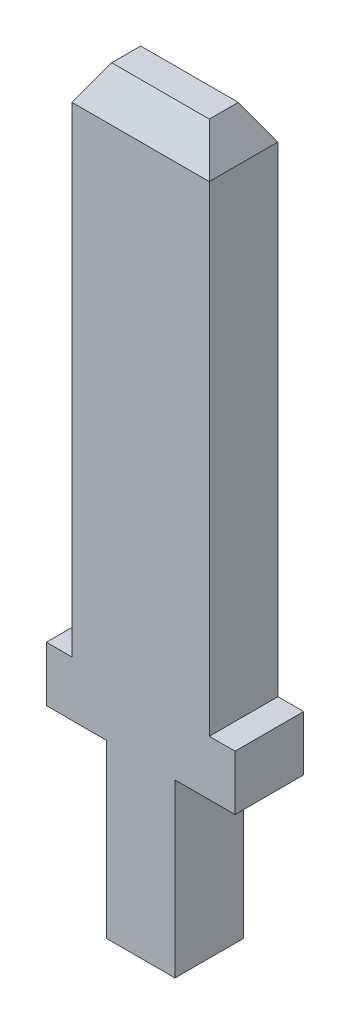
ISO-10303-21;
HEADER;
FILE_DESCRIPTION(('STEP AP214'),'2;1');
FILE_NAME('part.step','',(''),(''),'','','');
FILE_SCHEMA(('AUTOMOTIVE_DESIGN { 1 0 10303 214 1 1 1 1 }'));
ENDSEC;
DATA;
#1=APPLICATION_CONTEXT('core data for automotive mechanical design processes');
#2=APPLICATION_PROTOCOL_DEFINITION('international standard','automotive_design',2000,#1);
#3=PRODUCT_CONTEXT('',#1,'mechanical');
#4=PRODUCT('Part','Part','',(#3));
#5=PRODUCT_RELATED_PRODUCT_CATEGORY('part','',(#4));
#6=PRODUCT_DEFINITION_FORMATION('','',#4);
#7=PRODUCT_DEFINITION_CONTEXT('part definition',#1,'design');
#8=PRODUCT_DEFINITION('design','',#6,#7);
#9=PRODUCT_DEFINITION_SHAPE('','',#8);
#10=(LENGTH_UNIT() NAMED_UNIT(*) SI_UNIT(.MILLI.,.METRE.));
#11=(NAMED_UNIT(*) PLANE_ANGLE_UNIT() SI_UNIT($,.RADIAN.));
#12=(NAMED_UNIT(*) SI_UNIT($,.STERADIAN.) SOLID_ANGLE_UNIT());
#13=UNCERTAINTY_MEASURE_WITH_UNIT(LENGTH_MEASURE(1.E-05),#10,'distance_accuracy_value','');
#14=(GEOMETRIC_REPRESENTATION_CONTEXT(3) GLOBAL_UNCERTAINTY_ASSIGNED_CONTEXT((#13)) GLOBAL_UNIT_ASSIGNED_CONTEXT((#10,
#11,#12)) REPRESENTATION_CONTEXT('',''));
#15=CARTESIAN_POINT('',(0.,0.,0.));
#16=DIRECTION('',(0.,0.,1.));
#17=DIRECTION('',(1.,0.,0.));
#18=AXIS2_PLACEMENT_3D('',#15,#16,#17);
#19=CARTESIAN_POINT('',(-0.999999999999998,0.,1.));
#20=DIRECTION('',(1.,0.,0.));
#21=DIRECTION('',(0.,1.,0.));
#22=AXIS2_PLACEMENT_3D('',#19,#20,#21);
#23=PLANE('',#22);
#24=DIRECTION('',(0.,-1.,0.));
#25=VECTOR('',#24,1.);
#26=CARTESIAN_POINT('',(-0.999999999999998,0.,-1.));
#27=LINE('',#26,#25);
#28=CARTESIAN_POINT('',(-0.999999999999998,5.,-1.));
#29=VERTEX_POINT('',#28);
#30=CARTESIAN_POINT('',(-0.999999999999998,0.,-1.));
#31=VERTEX_POINT('',#30);
#32=EDGE_CURVE('E158',#29,#31,#27,.T.);
#33=ORIENTED_EDGE('',*,*,#32,.T.);
#34=DIRECTION('',(0.,0.,-1.));
#35=VECTOR('',#34,1.);
#36=CARTESIAN_POINT('',(-0.999999999999998,0.,1.));
#37=LINE('',#36,#35);
#38=CARTESIAN_POINT('',(-0.999999999999998,0.,1.));
#39=VERTEX_POINT('',#38);
#40=EDGE_CURVE('E140',#39,#31,#37,.T.);
#41=ORIENTED_EDGE('',*,*,#40,.F.);
#42=DIRECTION('',(0.,-1.,0.));
#43=VECTOR('',#42,1.);
#44=CARTESIAN_POINT('',(-0.999999999999998,0.,1.));
#45=LINE('',#44,#43);
#46=CARTESIAN_POINT('',(-0.999999999999998,5.,1.));
#47=VERTEX_POINT('',#46);
#48=EDGE_CURVE('E146',#47,#39,#45,.T.);
#49=ORIENTED_EDGE('',*,*,#48,.F.);
#50=DIRECTION('',(0.,0.,-1.));
#51=VECTOR('',#50,1.);
#52=CARTESIAN_POINT('',(-0.999999999999998,5.,1.));
#53=LINE('',#52,#51);
#54=EDGE_CURVE('E215',#47,#29,#53,.T.);
#55=ORIENTED_EDGE('',*,*,#54,.T.);
#56=EDGE_LOOP('',(#33,#41,#49,#55));
#57=FACE_BOUND('',#56,.T.);
#58=ADVANCED_FACE('F34',(#57),#23,.F.);
#59=CARTESIAN_POINT('',(0.999999999999998,0.,1.));
#60=DIRECTION('',(0.,1.,0.));
#61=DIRECTION('',(-1.,0.,0.));
#62=AXIS2_PLACEMENT_3D('',#59,#60,#61);
#63=PLANE('',#62);
#64=DIRECTION('',(1.,0.,0.));
#65=VECTOR('',#64,1.);
#66=CARTESIAN_POINT('',(0.999999999999998,0.,-1.));
#67=LINE('',#66,#65);
#68=CARTESIAN_POINT('',(0.999999999999998,0.,-1.));
#69=VERTEX_POINT('',#68);
#70=EDGE_CURVE('E191',#31,#69,#67,.T.);
#71=ORIENTED_EDGE('',*,*,#70,.T.);
#72=DIRECTION('',(0.,0.,-1.));
#73=VECTOR('',#72,1.);
#74=CARTESIAN_POINT('',(0.999999999999998,0.,1.));
#75=LINE('',#74,#73);
#76=CARTESIAN_POINT('',(0.999999999999998,0.,1.));
#77=VERTEX_POINT('',#76);
#78=EDGE_CURVE('E143',#77,#69,#75,.T.);
#79=ORIENTED_EDGE('',*,*,#78,.F.);
#80=DIRECTION('',(1.,0.,0.));
#81=VECTOR('',#80,1.);
#82=CARTESIAN_POINT('',(0.999999999999998,0.,1.));
#83=LINE('',#82,#81);
#84=EDGE_CURVE('E136',#39,#77,#83,.T.);
#85=ORIENTED_EDGE('',*,*,#84,.F.);
#86=ORIENTED_EDGE('',*,*,#40,.T.);
#87=EDGE_LOOP('',(#71,#79,#85,#86));
#88=FACE_BOUND('',#87,.T.);
#89=ADVANCED_FACE('F138',(#88),#63,.F.);
#90=CARTESIAN_POINT('',(0.999999999999998,0.,1.));
#91=DIRECTION('',(-1.,0.,0.));
#92=DIRECTION('',(0.,-1.,0.));
#93=AXIS2_PLACEMENT_3D('',#90,#91,#92);
#94=PLANE('',#93);
#95=DIRECTION('',(0.,1.,0.));
#96=VECTOR('',#95,1.);
#97=CARTESIAN_POINT('',(0.999999999999998,0.,-1.));
#98=LINE('',#97,#96);
#99=CARTESIAN_POINT('',(1.,5.,-1.));
#100=VERTEX_POINT('',#99);
#101=EDGE_CURVE('E193',#69,#100,#98,.T.);
#102=ORIENTED_EDGE('',*,*,#101,.T.);
#103=DIRECTION('',(0.,0.,-1.));
#104=VECTOR('',#103,1.);
#105=CARTESIAN_POINT('',(1.,5.,1.));
#106=LINE('',#105,#104);
#107=CARTESIAN_POINT('',(1.,5.,1.));
#108=VERTEX_POINT('',#107);
#109=EDGE_CURVE('E163',#108,#100,#106,.T.);
#110=ORIENTED_EDGE('',*,*,#109,.F.);
#111=DIRECTION('',(0.,1.,0.));
#112=VECTOR('',#111,1.);
#113=CARTESIAN_POINT('',(0.999999999999998,0.,1.));
#114=LINE('',#113,#112);
#115=EDGE_CURVE('E145',#77,#108,#114,.T.);
#116=ORIENTED_EDGE('',*,*,#115,.F.);
#117=ORIENTED_EDGE('',*,*,#78,.T.);
#118=EDGE_LOOP('',(#102,#110,#116,#117));
#119=FACE_BOUND('',#118,.T.);
#120=ADVANCED_FACE('F280',(#119),#94,.F.);
#121=CARTESIAN_POINT('',(1.,5.,1.));
#122=DIRECTION('',(0.,1.,0.));
#123=DIRECTION('',(-1.,0.,0.));
#124=AXIS2_PLACEMENT_3D('',#121,#122,#123);
#125=PLANE('',#124);
#126=DIRECTION('',(1.,0.,0.));
#127=VECTOR('',#126,1.);
#128=CARTESIAN_POINT('',(1.,5.,-1.));
#129=LINE('',#128,#127);
#130=CARTESIAN_POINT('',(2.75,5.,-1.));
#131=VERTEX_POINT('',#130);
#132=EDGE_CURVE('E199',#100,#131,#129,.T.);
#133=ORIENTED_EDGE('',*,*,#132,.T.);
#134=DIRECTION('',(0.,0.,-1.));
#135=VECTOR('',#134,1.);
#136=CARTESIAN_POINT('',(2.75,5.,1.));
#137=LINE('',#136,#135);
#138=CARTESIAN_POINT('',(2.75,5.,1.));
#139=VERTEX_POINT('',#138);
#140=EDGE_CURVE('E232',#139,#131,#137,.T.);
#141=ORIENTED_EDGE('',*,*,#140,.F.);
#142=DIRECTION('',(1.,0.,0.));
#143=VECTOR('',#142,1.);
#144=CARTESIAN_POINT('',(1.,5.,1.));
#145=LINE('',#144,#143);
#146=EDGE_CURVE('E241',#108,#139,#145,.T.);
#147=ORIENTED_EDGE('',*,*,#146,.F.);
#148=ORIENTED_EDGE('',*,*,#109,.T.);
#149=EDGE_LOOP('',(#133,#141,#147,#148));
#150=FACE_BOUND('',#149,.T.);
#151=ADVANCED_FACE('F239',(#150),#125,.F.);
#152=CARTESIAN_POINT('',(2.75,5.,1.));
#153=DIRECTION('',(-1.,0.,0.));
#154=DIRECTION('',(0.,-1.,0.));
#155=AXIS2_PLACEMENT_3D('',#152,#153,#154);
#156=PLANE('',#155);
#157=DIRECTION('',(0.,1.,0.));
#158=VECTOR('',#157,1.);
#159=CARTESIAN_POINT('',(2.75,5.,-1.));
#160=LINE('',#159,#158);
#161=CARTESIAN_POINT('',(2.75,6.6,-1.));
#162=VERTEX_POINT('',#161);
#163=EDGE_CURVE('E201',#131,#162,#160,.T.);
#164=ORIENTED_EDGE('',*,*,#163,.T.);
#165=DIRECTION('',(0.,0.,-1.));
#166=VECTOR('',#165,1.);
#167=CARTESIAN_POINT('',(2.75,6.6,1.));
#168=LINE('',#167,#166);
#169=CARTESIAN_POINT('',(2.75,6.6,1.));
#170=VERTEX_POINT('',#169);
#171=EDGE_CURVE('E229',#170,#162,#168,.T.);
#172=ORIENTED_EDGE('',*,*,#171,.F.);
#173=DIRECTION('',(0.,1.,0.));
#174=VECTOR('',#173,1.);
#175=CARTESIAN_POINT('',(2.75,5.,1.));
#176=LINE('',#175,#174);
#177=EDGE_CURVE('E260',#139,#170,#176,.T.);
#178=ORIENTED_EDGE('',*,*,#177,.F.);
#179=ORIENTED_EDGE('',*,*,#140,.T.);
#180=EDGE_LOOP('',(#164,#172,#178,#179));
#181=FACE_BOUND('',#180,.T.);
#182=ADVANCED_FACE('F251',(#181),#156,.F.);
#183=CARTESIAN_POINT('',(2.75,6.6,1.));
#184=DIRECTION('',(0.,-1.,0.));
#185=DIRECTION('',(0.,0.,-1.));
#186=AXIS2_PLACEMENT_3D('',#183,#184,#185);
#187=PLANE('',#186);
#188=DIRECTION('',(-1.,0.,0.));
#189=VECTOR('',#188,1.);
#190=CARTESIAN_POINT('',(2.75,6.6,-1.));
#191=LINE('',#190,#189);
#192=CARTESIAN_POINT('',(2.,6.6,-1.));
#193=VERTEX_POINT('',#192);
#194=EDGE_CURVE('E203',#162,#193,#191,.T.);
#195=ORIENTED_EDGE('',*,*,#194,.T.);
#196=DIRECTION('',(0.,0.,-1.));
#197=VECTOR('',#196,1.);
#198=CARTESIAN_POINT('',(2.,6.6,1.));
#199=LINE('',#198,#197);
#200=CARTESIAN_POINT('',(2.,6.6,1.));
#201=VERTEX_POINT('',#200);
#202=EDGE_CURVE('E226',#201,#193,#199,.T.);
#203=ORIENTED_EDGE('',*,*,#202,.F.);
#204=DIRECTION('',(-1.,0.,0.));
#205=VECTOR('',#204,1.);
#206=CARTESIAN_POINT('',(2.75,6.6,1.));
#207=LINE('',#206,#205);
#208=EDGE_CURVE('E257',#170,#201,#207,.T.);
#209=ORIENTED_EDGE('',*,*,#208,.F.);
#210=ORIENTED_EDGE('',*,*,#171,.T.);
#211=EDGE_LOOP('',(#195,#203,#209,#210));
#212=FACE_BOUND('',#211,.T.);
#213=ADVANCED_FACE('F255',(#212),#187,.F.);
#214=CARTESIAN_POINT('',(2.,6.6,1.));
#215=DIRECTION('',(-1.,0.,0.));
#216=DIRECTION('',(0.,-1.,0.));
#217=AXIS2_PLACEMENT_3D('',#214,#215,#216);
#218=PLANE('',#217);
#219=DIRECTION('',(0.,1.,0.));
#220=VECTOR('',#219,1.);
#221=CARTESIAN_POINT('',(2.,6.6,-1.));
#222=LINE('',#221,#220);
#223=CARTESIAN_POINT('',(2.,20.6,-1.));
#224=VERTEX_POINT('',#223);
#225=EDGE_CURVE('E205',#193,#224,#222,.T.);
#226=ORIENTED_EDGE('',*,*,#225,.T.);
#227=DIRECTION('',(0.,0.,1.));
#228=VECTOR('',#227,1.);
#229=CARTESIAN_POINT('',(2.,20.6,1.));
#230=LINE('',#229,#228);
#231=CARTESIAN_POINT('',(2.,20.6,1.));
#232=VERTEX_POINT('',#231);
#233=EDGE_CURVE('E173',#224,#232,#230,.T.);
#234=ORIENTED_EDGE('',*,*,#233,.T.);
#235=DIRECTION('',(0.,1.,0.));
#236=VECTOR('',#235,1.);
#237=CARTESIAN_POINT('',(2.,6.6,1.));
#238=LINE('',#237,#236);
#239=EDGE_CURVE('E259',#201,#232,#238,.T.);
#240=ORIENTED_EDGE('',*,*,#239,.F.);
#241=ORIENTED_EDGE('',*,*,#202,.T.);
#242=EDGE_LOOP('',(#226,#234,#240,#241));
#243=FACE_BOUND('',#242,.T.);
#244=ADVANCED_FACE('F316',(#243),#218,.F.);
#245=CARTESIAN_POINT('',(-2.,21.6,1.));
#246=DIRECTION('',(0.,-1.,0.));
#247=DIRECTION('',(0.,0.,-1.));
#248=AXIS2_PLACEMENT_3D('',#245,#246,#247);
#249=PLANE('',#248);
#250=DIRECTION('',(1.,0.,0.));
#251=VECTOR('',#250,1.);
#252=CARTESIAN_POINT('',(2.,21.6,0.422649730810372));
#253=LINE('',#252,#251);
#254=CARTESIAN_POINT('',(-1.42264973081037,21.6,0.422649730810372));
#255=VERTEX_POINT('',#254);
#256=CARTESIAN_POINT('',(1.42264973081037,21.6,0.422649730810372));
#257=VERTEX_POINT('',#256);
#258=EDGE_CURVE('E168',#255,#257,#253,.T.);
#259=ORIENTED_EDGE('',*,*,#258,.T.);
#260=DIRECTION('',(0.,0.,-1.));
#261=VECTOR('',#260,1.);
#262=CARTESIAN_POINT('',(1.42264973081037,21.6,1.));
#263=LINE('',#262,#261);
#264=CARTESIAN_POINT('',(1.42264973081037,21.6,-0.422649730810372));
#265=VERTEX_POINT('',#264);
#266=EDGE_CURVE('E170',#257,#265,#263,.T.);
#267=ORIENTED_EDGE('',*,*,#266,.T.);
#268=DIRECTION('',(-1.,0.,0.));
#269=VECTOR('',#268,1.);
#270=CARTESIAN_POINT('',(-2.,21.6,-0.422649730810372));
#271=LINE('',#270,#269);
#272=CARTESIAN_POINT('',(-1.42264973081037,21.6,-0.422649730810372));
#273=VERTEX_POINT('',#272);
#274=EDGE_CURVE('E159',#265,#273,#271,.T.);
#275=ORIENTED_EDGE('',*,*,#274,.T.);
#276=DIRECTION('',(0.,0.,1.));
#277=VECTOR('',#276,1.);
#278=CARTESIAN_POINT('',(-1.42264973081037,21.6,1.));
#279=LINE('',#278,#277);
#280=EDGE_CURVE('E161',#273,#255,#279,.T.);
#281=ORIENTED_EDGE('',*,*,#280,.T.);
#282=EDGE_LOOP('',(#259,#267,#275,#281));
#283=FACE_BOUND('',#282,.T.);
#284=ADVANCED_FACE('F320',(#283),#249,.F.);
#285=CARTESIAN_POINT('',(-2.,6.6,1.));
#286=DIRECTION('',(1.,0.,0.));
#287=DIRECTION('',(0.,0.,-1.));
#288=AXIS2_PLACEMENT_3D('',#285,#286,#287);
#289=PLANE('',#288);
#290=DIRECTION('',(0.,-1.,0.));
#291=VECTOR('',#290,1.);
#292=CARTESIAN_POINT('',(-2.,6.6,1.));
#293=LINE('',#292,#291);
#294=CARTESIAN_POINT('',(-2.,20.6,1.));
#295=VERTEX_POINT('',#294);
#296=CARTESIAN_POINT('',(-2.,6.6,1.));
#297=VERTEX_POINT('',#296);
#298=EDGE_CURVE('E262',#295,#297,#293,.T.);
#299=ORIENTED_EDGE('',*,*,#298,.F.);
#300=DIRECTION('',(0.,0.,-1.));
#301=VECTOR('',#300,1.);
#302=CARTESIAN_POINT('',(-2.,20.6,1.));
#303=LINE('',#302,#301);
#304=CARTESIAN_POINT('',(-2.,20.6,-1.));
#305=VERTEX_POINT('',#304);
#306=EDGE_CURVE('E43',#295,#305,#303,.T.);
#307=ORIENTED_EDGE('',*,*,#306,.T.);
#308=DIRECTION('',(0.,-1.,0.));
#309=VECTOR('',#308,1.);
#310=CARTESIAN_POINT('',(-2.,6.6,-1.));
#311=LINE('',#310,#309);
#312=CARTESIAN_POINT('',(-2.,6.6,-1.));
#313=VERTEX_POINT('',#312);
#314=EDGE_CURVE('E208',#305,#313,#311,.T.);
#315=ORIENTED_EDGE('',*,*,#314,.T.);
#316=DIRECTION('',(0.,0.,-1.));
#317=VECTOR('',#316,1.);
#318=CARTESIAN_POINT('',(-2.,6.6,1.));
#319=LINE('',#318,#317);
#320=EDGE_CURVE('E223',#297,#313,#319,.T.);
#321=ORIENTED_EDGE('',*,*,#320,.F.);
#322=EDGE_LOOP('',(#299,#307,#315,#321));
#323=FACE_BOUND('',#322,.T.);
#324=ADVANCED_FACE('F322',(#323),#289,.F.);
#325=CARTESIAN_POINT('',(-2.75,6.6,1.));
#326=DIRECTION('',(0.,-1.,0.));
#327=DIRECTION('',(0.,0.,-1.));
#328=AXIS2_PLACEMENT_3D('',#325,#326,#327);
#329=PLANE('',#328);
#330=DIRECTION('',(-1.,0.,0.));
#331=VECTOR('',#330,1.);
#332=CARTESIAN_POINT('',(-2.75,6.6,-1.));
#333=LINE('',#332,#331);
#334=CARTESIAN_POINT('',(-2.75,6.6,-1.));
#335=VERTEX_POINT('',#334);
#336=EDGE_CURVE('E210',#313,#335,#333,.T.);
#337=ORIENTED_EDGE('',*,*,#336,.T.);
#338=DIRECTION('',(0.,0.,-1.));
#339=VECTOR('',#338,1.);
#340=CARTESIAN_POINT('',(-2.75,6.6,1.));
#341=LINE('',#340,#339);
#342=CARTESIAN_POINT('',(-2.75,6.6,1.));
#343=VERTEX_POINT('',#342);
#344=EDGE_CURVE('E220',#343,#335,#341,.T.);
#345=ORIENTED_EDGE('',*,*,#344,.F.);
#346=DIRECTION('',(-1.,0.,0.));
#347=VECTOR('',#346,1.);
#348=CARTESIAN_POINT('',(-2.75,6.6,1.));
#349=LINE('',#348,#347);
#350=EDGE_CURVE('E268',#297,#343,#349,.T.);
#351=ORIENTED_EDGE('',*,*,#350,.F.);
#352=ORIENTED_EDGE('',*,*,#320,.T.);
#353=EDGE_LOOP('',(#337,#345,#351,#352));
#354=FACE_BOUND('',#353,.T.);
#355=ADVANCED_FACE('F328',(#354),#329,.F.);
#356=CARTESIAN_POINT('',(-2.75,5.,1.));
#357=DIRECTION('',(1.,0.,0.));
#358=DIRECTION('',(0.,0.,-1.));
#359=AXIS2_PLACEMENT_3D('',#356,#357,#358);
#360=PLANE('',#359);
#361=DIRECTION('',(0.,-1.,0.));
#362=VECTOR('',#361,1.);
#363=CARTESIAN_POINT('',(-2.75,5.,-1.));
#364=LINE('',#363,#362);
#365=CARTESIAN_POINT('',(-2.75,5.,-1.));
#366=VERTEX_POINT('',#365);
#367=EDGE_CURVE('E212',#335,#366,#364,.T.);
#368=ORIENTED_EDGE('',*,*,#367,.T.);
#369=DIRECTION('',(0.,0.,-1.));
#370=VECTOR('',#369,1.);
#371=CARTESIAN_POINT('',(-2.75,5.,1.));
#372=LINE('',#371,#370);
#373=CARTESIAN_POINT('',(-2.75,5.,1.));
#374=VERTEX_POINT('',#373);
#375=EDGE_CURVE('E217',#374,#366,#372,.T.);
#376=ORIENTED_EDGE('',*,*,#375,.F.);
#377=DIRECTION('',(0.,-1.,0.));
#378=VECTOR('',#377,1.);
#379=CARTESIAN_POINT('',(-2.75,5.,1.));
#380=LINE('',#379,#378);
#381=EDGE_CURVE('E269',#343,#374,#380,.T.);
#382=ORIENTED_EDGE('',*,*,#381,.F.);
#383=ORIENTED_EDGE('',*,*,#344,.T.);
#384=EDGE_LOOP('',(#368,#376,#382,#383));
#385=FACE_BOUND('',#384,.T.);
#386=ADVANCED_FACE('F275',(#385),#360,.F.);
#387=CARTESIAN_POINT('',(-0.999999999999998,5.,1.));
#388=DIRECTION('',(0.,1.,0.));
#389=DIRECTION('',(0.,0.,1.));
#390=AXIS2_PLACEMENT_3D('',#387,#388,#389);
#391=PLANE('',#390);
#392=DIRECTION('',(1.,0.,0.));
#393=VECTOR('',#392,1.);
#394=CARTESIAN_POINT('',(-0.999999999999998,5.,-1.));
#395=LINE('',#394,#393);
#396=EDGE_CURVE('E155',#366,#29,#395,.T.);
#397=ORIENTED_EDGE('',*,*,#396,.T.);
#398=ORIENTED_EDGE('',*,*,#54,.F.);
#399=DIRECTION('',(1.,0.,0.));
#400=VECTOR('',#399,1.);
#401=CARTESIAN_POINT('',(-0.999999999999998,5.,1.));
#402=LINE('',#401,#400);
#403=EDGE_CURVE('E151',#374,#47,#402,.T.);
#404=ORIENTED_EDGE('',*,*,#403,.F.);
#405=ORIENTED_EDGE('',*,*,#375,.T.);
#406=EDGE_LOOP('',(#397,#398,#404,#405));
#407=FACE_BOUND('',#406,.T.);
#408=ADVANCED_FACE('F279',(#407),#391,.F.);
#409=CARTESIAN_POINT('',(0.,0.,1.));
#410=DIRECTION('',(0.,0.,1.));
#411=DIRECTION('',(1.,0.,0.));
#412=AXIS2_PLACEMENT_3D('',#409,#410,#411);
#413=PLANE('',#412);
#414=ORIENTED_EDGE('',*,*,#239,.T.);
#415=DIRECTION('',(-1.,0.,0.));
#416=VECTOR('',#415,1.);
#417=CARTESIAN_POINT('',(-2.,20.6,1.));
#418=LINE('',#417,#416);
#419=EDGE_CURVE('E58',#232,#295,#418,.T.);
#420=ORIENTED_EDGE('',*,*,#419,.T.);
#421=ORIENTED_EDGE('',*,*,#298,.T.);
#422=ORIENTED_EDGE('',*,*,#350,.T.);
#423=ORIENTED_EDGE('',*,*,#381,.T.);
#424=ORIENTED_EDGE('',*,*,#403,.T.);
#425=ORIENTED_EDGE('',*,*,#48,.T.);
#426=ORIENTED_EDGE('',*,*,#84,.T.);
#427=ORIENTED_EDGE('',*,*,#115,.T.);
#428=ORIENTED_EDGE('',*,*,#146,.T.);
#429=ORIENTED_EDGE('',*,*,#177,.T.);
#430=ORIENTED_EDGE('',*,*,#208,.T.);
#431=EDGE_LOOP('',(#414,#420,#421,#422,#423,#424,#425,#426,#427,#428,#429,#430));
#432=FACE_BOUND('',#431,.T.);
#433=ADVANCED_FACE('F149',(#432),#413,.T.);
#434=CARTESIAN_POINT('',(0.,0.,-1.));
#435=DIRECTION('',(0.,0.,1.));
#436=DIRECTION('',(1.,0.,0.));
#437=AXIS2_PLACEMENT_3D('',#434,#435,#436);
#438=PLANE('',#437);
#439=ORIENTED_EDGE('',*,*,#314,.F.);
#440=DIRECTION('',(1.,0.,0.));
#441=VECTOR('',#440,1.);
#442=CARTESIAN_POINT('',(0.,20.6,-1.));
#443=LINE('',#442,#441);
#444=EDGE_CURVE('E11',#305,#224,#443,.T.);
#445=ORIENTED_EDGE('',*,*,#444,.T.);
#446=ORIENTED_EDGE('',*,*,#225,.F.);
#447=ORIENTED_EDGE('',*,*,#194,.F.);
#448=ORIENTED_EDGE('',*,*,#163,.F.);
#449=ORIENTED_EDGE('',*,*,#132,.F.);
#450=ORIENTED_EDGE('',*,*,#101,.F.);
#451=ORIENTED_EDGE('',*,*,#70,.F.);
#452=ORIENTED_EDGE('',*,*,#32,.F.);
#453=ORIENTED_EDGE('',*,*,#396,.F.);
#454=ORIENTED_EDGE('',*,*,#367,.F.);
#455=ORIENTED_EDGE('',*,*,#336,.F.);
#456=EDGE_LOOP('',(#439,#445,#446,#447,#448,#449,#450,#451,#452,#453,#454,#455));
#457=FACE_BOUND('',#456,.T.);
#458=ADVANCED_FACE('F246',(#457),#438,.F.);
#459=CARTESIAN_POINT('',(-2.,20.6,1.));
#460=DIRECTION('',(0.86602540378444,-0.499999999999999,0.));
#461=DIRECTION('',(0.,0.,-1.));
#462=AXIS2_PLACEMENT_3D('',#459,#460,#461);
#463=PLANE('',#462);
#464=DIRECTION('',(0.447213595499957,0.774596669241485,0.447213595499957));
#465=VECTOR('',#464,1.);
#466=CARTESIAN_POINT('',(-1.5381197846483,21.4,-0.538119784648297));
#467=LINE('',#466,#465);
#468=EDGE_CURVE('E181',#305,#273,#467,.T.);
#469=ORIENTED_EDGE('',*,*,#468,.F.);
#470=ORIENTED_EDGE('',*,*,#306,.F.);
#471=DIRECTION('',(-0.447213595499957,-0.774596669241485,0.447213595499957));
#472=VECTOR('',#471,1.);
#473=CARTESIAN_POINT('',(-2.,20.6,1.));
#474=LINE('',#473,#472);
#475=EDGE_CURVE('E38',#255,#295,#474,.T.);
#476=ORIENTED_EDGE('',*,*,#475,.F.);
#477=ORIENTED_EDGE('',*,*,#280,.F.);
#478=EDGE_LOOP('',(#469,#470,#476,#477));
#479=FACE_BOUND('',#478,.T.);
#480=ADVANCED_FACE('F36',(#479),#463,.F.);
#481=CARTESIAN_POINT('',(0.,20.6,1.));
#482=DIRECTION('',(0.,0.499999999999999,0.86602540378444));
#483=DIRECTION('',(1.,0.,0.));
#484=AXIS2_PLACEMENT_3D('',#481,#482,#483);
#485=PLANE('',#484);
#486=ORIENTED_EDGE('',*,*,#475,.T.);
#487=ORIENTED_EDGE('',*,*,#419,.F.);
#488=DIRECTION('',(0.447213595499957,-0.774596669241484,0.447213595499957));
#489=VECTOR('',#488,1.);
#490=CARTESIAN_POINT('',(1.6,21.2928203230275,0.600000000000002));
#491=LINE('',#490,#489);
#492=EDGE_CURVE('E180',#257,#232,#491,.T.);
#493=ORIENTED_EDGE('',*,*,#492,.F.);
#494=ORIENTED_EDGE('',*,*,#258,.F.);
#495=EDGE_LOOP('',(#486,#487,#493,#494));
#496=FACE_BOUND('',#495,.T.);
#497=ADVANCED_FACE('F301',(#496),#485,.T.);
#498=CARTESIAN_POINT('',(-2.,21.6,-0.422649730810372));
#499=DIRECTION('',(0.,-0.499999999999999,0.86602540378444));
#500=DIRECTION('',(-1.,0.,0.));
#501=AXIS2_PLACEMENT_3D('',#498,#499,#500);
#502=PLANE('',#501);
#503=ORIENTED_EDGE('',*,*,#468,.T.);
#504=ORIENTED_EDGE('',*,*,#274,.F.);
#505=DIRECTION('',(0.447213595499957,-0.774596669241484,-0.447213595499957));
#506=VECTOR('',#505,1.);
#507=CARTESIAN_POINT('',(0.738119784648299,22.7856406460551,0.261880215351699));
#508=LINE('',#507,#506);
#509=EDGE_CURVE('E178',#224,#265,#508,.F.);
#510=ORIENTED_EDGE('',*,*,#509,.F.);
#511=ORIENTED_EDGE('',*,*,#444,.F.);
#512=EDGE_LOOP('',(#503,#504,#510,#511));
#513=FACE_BOUND('',#512,.T.);
#514=ADVANCED_FACE('F298',(#513),#502,.F.);
#515=CARTESIAN_POINT('',(1.42264973081037,21.6,1.));
#516=DIRECTION('',(-0.866025403784439,-0.499999999999999,0.));
#517=DIRECTION('',(0.,0.,-1.));
#518=AXIS2_PLACEMENT_3D('',#515,#516,#517);
#519=PLANE('',#518);
#520=ORIENTED_EDGE('',*,*,#492,.T.);
#521=ORIENTED_EDGE('',*,*,#233,.F.);
#522=ORIENTED_EDGE('',*,*,#509,.T.);
#523=ORIENTED_EDGE('',*,*,#266,.F.);
#524=EDGE_LOOP('',(#520,#521,#522,#523));
#525=FACE_BOUND('',#524,.T.);
#526=ADVANCED_FACE('F295',(#525),#519,.F.);
#527=CLOSED_SHELL('',(#58,#89,#120,#151,#182,#213,#244,#284,#324,#355,#386,#408,#433,#458,#480,
#497,#514,#526));
#528=MANIFOLD_SOLID_BREP('B2',#527);
#529=ADVANCED_BREP_SHAPE_REPRESENTATION('',(#18,#528),#14);
#530=SHAPE_DEFINITION_REPRESENTATION(#9,#529);
ENDSEC;
END-ISO-10303-21;
